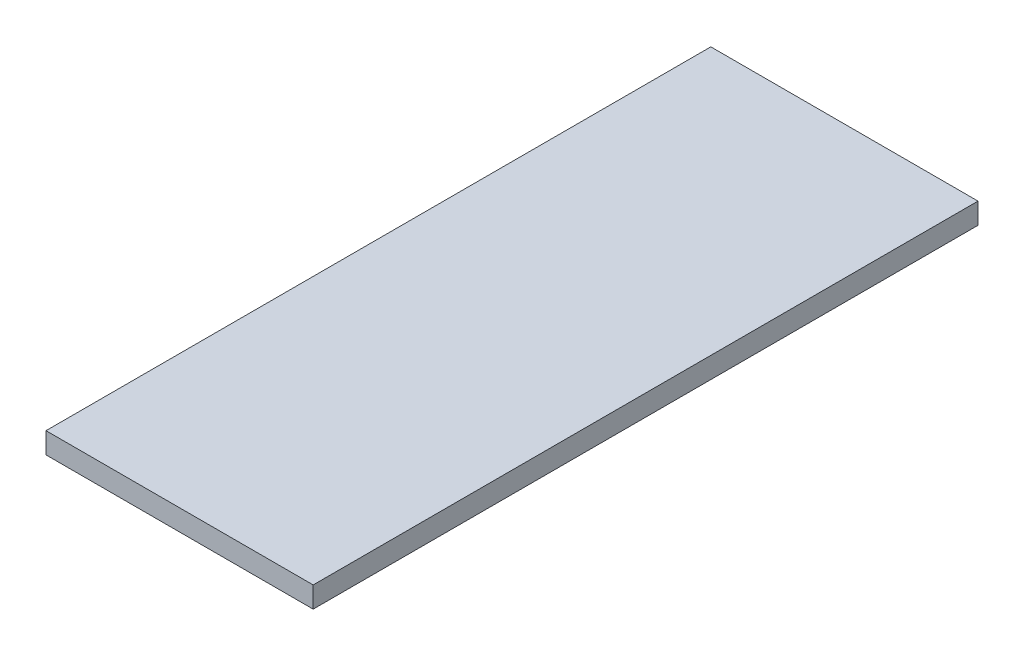
ISO-10303-21;
HEADER;
FILE_DESCRIPTION(('STEP AP214'),'2;1');
FILE_NAME('part.step','',(''),(''),'','','');
FILE_SCHEMA(('AUTOMOTIVE_DESIGN { 1 0 10303 214 1 1 1 1 }'));
ENDSEC;
DATA;
#1=APPLICATION_CONTEXT('core data for automotive mechanical design processes');
#2=APPLICATION_PROTOCOL_DEFINITION('international standard','automotive_design',2000,#1);
#3=PRODUCT_CONTEXT('',#1,'mechanical');
#4=PRODUCT('Part','Part','',(#3));
#5=PRODUCT_RELATED_PRODUCT_CATEGORY('part','',(#4));
#6=PRODUCT_DEFINITION_FORMATION('','',#4);
#7=PRODUCT_DEFINITION_CONTEXT('part definition',#1,'design');
#8=PRODUCT_DEFINITION('design','',#6,#7);
#9=PRODUCT_DEFINITION_SHAPE('','',#8);
#10=(LENGTH_UNIT() NAMED_UNIT(*) SI_UNIT(.MILLI.,.METRE.));
#11=(NAMED_UNIT(*) PLANE_ANGLE_UNIT() SI_UNIT($,.RADIAN.));
#12=(NAMED_UNIT(*) SI_UNIT($,.STERADIAN.) SOLID_ANGLE_UNIT());
#13=UNCERTAINTY_MEASURE_WITH_UNIT(LENGTH_MEASURE(1.E-05),#10,'distance_accuracy_value','');
#14=(GEOMETRIC_REPRESENTATION_CONTEXT(3) GLOBAL_UNCERTAINTY_ASSIGNED_CONTEXT((#13)) GLOBAL_UNIT_ASSIGNED_CONTEXT((#10,
#11,#12)) REPRESENTATION_CONTEXT('',''));
#15=CARTESIAN_POINT('',(0.,0.,0.));
#16=DIRECTION('',(0.,0.,1.));
#17=DIRECTION('',(1.,0.,0.));
#18=AXIS2_PLACEMENT_3D('',#15,#16,#17);
#19=CARTESIAN_POINT('',(700.,55.,3483.5));
#20=DIRECTION('',(-1.,0.,0.));
#21=DIRECTION('',(0.,0.,1.));
#22=AXIS2_PLACEMENT_3D('',#19,#20,#21);
#23=PLANE('',#22);
#24=DIRECTION('',(0.,1.,0.));
#25=VECTOR('',#24,1.);
#26=CARTESIAN_POINT('',(700.,55.,0.));
#27=LINE('',#26,#25);
#28=CARTESIAN_POINT('',(700.,-55.,0.));
#29=VERTEX_POINT('',#28);
#30=CARTESIAN_POINT('',(700.,55.,0.));
#31=VERTEX_POINT('',#30);
#32=EDGE_CURVE('E107',#29,#31,#27,.T.);
#33=ORIENTED_EDGE('',*,*,#32,.T.);
#34=DIRECTION('',(0.,0.,-1.));
#35=VECTOR('',#34,1.);
#36=CARTESIAN_POINT('',(700.,55.,3483.5));
#37=LINE('',#36,#35);
#38=CARTESIAN_POINT('',(700.,55.,3483.5));
#39=VERTEX_POINT('',#38);
#40=EDGE_CURVE('E11',#39,#31,#37,.T.);
#41=ORIENTED_EDGE('',*,*,#40,.F.);
#42=DIRECTION('',(0.,1.,0.));
#43=VECTOR('',#42,1.);
#44=CARTESIAN_POINT('',(700.,55.,3483.5));
#45=LINE('',#44,#43);
#46=CARTESIAN_POINT('',(700.,-55.,3483.5));
#47=VERTEX_POINT('',#46);
#48=EDGE_CURVE('E91',#47,#39,#45,.T.);
#49=ORIENTED_EDGE('',*,*,#48,.F.);
#50=DIRECTION('',(0.,0.,-1.));
#51=VECTOR('',#50,1.);
#52=CARTESIAN_POINT('',(700.,-55.,3483.5));
#53=LINE('',#52,#51);
#54=EDGE_CURVE('E103',#47,#29,#53,.T.);
#55=ORIENTED_EDGE('',*,*,#54,.T.);
#56=EDGE_LOOP('',(#33,#41,#49,#55));
#57=FACE_BOUND('',#56,.T.);
#58=ADVANCED_FACE('F39',(#57),#23,.F.);
#59=CARTESIAN_POINT('',(-700.,55.,3483.5));
#60=DIRECTION('',(0.,-1.,0.));
#61=DIRECTION('',(0.,0.,-1.));
#62=AXIS2_PLACEMENT_3D('',#59,#60,#61);
#63=PLANE('',#62);
#64=DIRECTION('',(-1.,0.,0.));
#65=VECTOR('',#64,1.);
#66=CARTESIAN_POINT('',(-700.,55.,0.));
#67=LINE('',#66,#65);
#68=CARTESIAN_POINT('',(-700.,55.,0.));
#69=VERTEX_POINT('',#68);
#70=EDGE_CURVE('E96',#31,#69,#67,.T.);
#71=ORIENTED_EDGE('',*,*,#70,.T.);
#72=DIRECTION('',(0.,0.,-1.));
#73=VECTOR('',#72,1.);
#74=CARTESIAN_POINT('',(-700.,55.,3483.5));
#75=LINE('',#74,#73);
#76=CARTESIAN_POINT('',(-700.,55.,3483.5));
#77=VERTEX_POINT('',#76);
#78=EDGE_CURVE('E48',#77,#69,#75,.T.);
#79=ORIENTED_EDGE('',*,*,#78,.F.);
#80=DIRECTION('',(-1.,0.,0.));
#81=VECTOR('',#80,1.);
#82=CARTESIAN_POINT('',(-700.,55.,3483.5));
#83=LINE('',#82,#81);
#84=EDGE_CURVE('E86',#39,#77,#83,.T.);
#85=ORIENTED_EDGE('',*,*,#84,.F.);
#86=ORIENTED_EDGE('',*,*,#40,.T.);
#87=EDGE_LOOP('',(#71,#79,#85,#86));
#88=FACE_BOUND('',#87,.T.);
#89=ADVANCED_FACE('F95',(#88),#63,.F.);
#90=CARTESIAN_POINT('',(-700.,55.,3483.5));
#91=DIRECTION('',(1.,0.,0.));
#92=DIRECTION('',(0.,0.,-1.));
#93=AXIS2_PLACEMENT_3D('',#90,#91,#92);
#94=PLANE('',#93);
#95=DIRECTION('',(0.,-1.,0.));
#96=VECTOR('',#95,1.);
#97=CARTESIAN_POINT('',(-700.,55.,0.));
#98=LINE('',#97,#96);
#99=CARTESIAN_POINT('',(-700.,-55.,0.));
#100=VERTEX_POINT('',#99);
#101=EDGE_CURVE('E73',#69,#100,#98,.T.);
#102=ORIENTED_EDGE('',*,*,#101,.T.);
#103=DIRECTION('',(0.,0.,-1.));
#104=VECTOR('',#103,1.);
#105=CARTESIAN_POINT('',(-700.,-55.,3483.5));
#106=LINE('',#105,#104);
#107=CARTESIAN_POINT('',(-700.,-55.,3483.5));
#108=VERTEX_POINT('',#107);
#109=EDGE_CURVE('E98',#108,#100,#106,.T.);
#110=ORIENTED_EDGE('',*,*,#109,.F.);
#111=DIRECTION('',(0.,-1.,0.));
#112=VECTOR('',#111,1.);
#113=CARTESIAN_POINT('',(-700.,55.,3483.5));
#114=LINE('',#113,#112);
#115=EDGE_CURVE('E89',#77,#108,#114,.T.);
#116=ORIENTED_EDGE('',*,*,#115,.F.);
#117=ORIENTED_EDGE('',*,*,#78,.T.);
#118=EDGE_LOOP('',(#102,#110,#116,#117));
#119=FACE_BOUND('',#118,.T.);
#120=ADVANCED_FACE('F99',(#119),#94,.F.);
#121=CARTESIAN_POINT('',(-700.,-55.,3483.5));
#122=DIRECTION('',(0.,1.,0.));
#123=DIRECTION('',(0.,0.,1.));
#124=AXIS2_PLACEMENT_3D('',#121,#122,#123);
#125=PLANE('',#124);
#126=DIRECTION('',(1.,0.,0.));
#127=VECTOR('',#126,1.);
#128=CARTESIAN_POINT('',(-700.,-55.,0.));
#129=LINE('',#128,#127);
#130=EDGE_CURVE('E79',#100,#29,#129,.T.);
#131=ORIENTED_EDGE('',*,*,#130,.T.);
#132=ORIENTED_EDGE('',*,*,#54,.F.);
#133=DIRECTION('',(1.,0.,0.));
#134=VECTOR('',#133,1.);
#135=CARTESIAN_POINT('',(-700.,-55.,3483.5));
#136=LINE('',#135,#134);
#137=EDGE_CURVE('E56',#108,#47,#136,.T.);
#138=ORIENTED_EDGE('',*,*,#137,.F.);
#139=ORIENTED_EDGE('',*,*,#109,.T.);
#140=EDGE_LOOP('',(#131,#132,#138,#139));
#141=FACE_BOUND('',#140,.T.);
#142=ADVANCED_FACE('F120',(#141),#125,.F.);
#143=CARTESIAN_POINT('',(0.,0.,3483.5));
#144=DIRECTION('',(0.,0.,1.));
#145=DIRECTION('',(1.,0.,0.));
#146=AXIS2_PLACEMENT_3D('',#143,#144,#145);
#147=PLANE('',#146);
#148=ORIENTED_EDGE('',*,*,#48,.T.);
#149=ORIENTED_EDGE('',*,*,#84,.T.);
#150=ORIENTED_EDGE('',*,*,#115,.T.);
#151=ORIENTED_EDGE('',*,*,#137,.T.);
#152=EDGE_LOOP('',(#148,#149,#150,#151));
#153=FACE_BOUND('',#152,.T.);
#154=ADVANCED_FACE('F87',(#153),#147,.T.);
#155=CARTESIAN_POINT('',(0.,0.,0.));
#156=DIRECTION('',(0.,0.,1.));
#157=DIRECTION('',(1.,0.,0.));
#158=AXIS2_PLACEMENT_3D('',#155,#156,#157);
#159=PLANE('',#158);
#160=ORIENTED_EDGE('',*,*,#32,.F.);
#161=ORIENTED_EDGE('',*,*,#130,.F.);
#162=ORIENTED_EDGE('',*,*,#101,.F.);
#163=ORIENTED_EDGE('',*,*,#70,.F.);
#164=EDGE_LOOP('',(#160,#161,#162,#163));
#165=FACE_BOUND('',#164,.T.);
#166=ADVANCED_FACE('F123',(#165),#159,.F.);
#167=CLOSED_SHELL('',(#58,#89,#120,#142,#154,#166));
#168=MANIFOLD_SOLID_BREP('B2',#167);
#169=ADVANCED_BREP_SHAPE_REPRESENTATION('',(#18,#168),#14);
#170=SHAPE_DEFINITION_REPRESENTATION(#9,#169);
ENDSEC;
END-ISO-10303-21;
